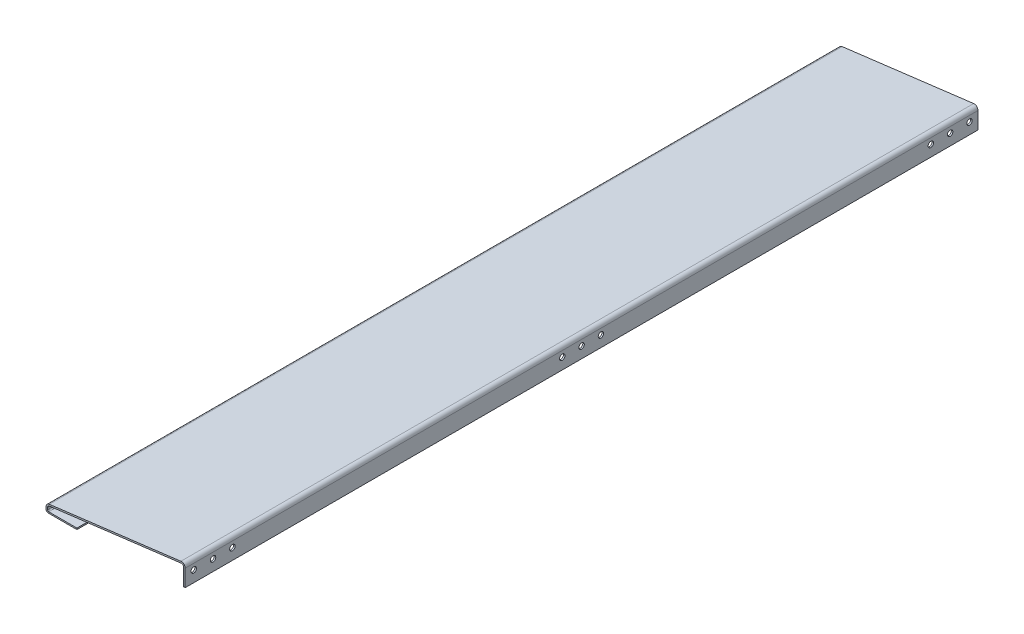
ISO-10303-21;
HEADER;
FILE_DESCRIPTION(('STEP AP214'),'2;1');
FILE_NAME('part.step','',(''),(''),'','','');
FILE_SCHEMA(('AUTOMOTIVE_DESIGN { 1 0 10303 214 1 1 1 1 }'));
ENDSEC;
DATA;
#1=APPLICATION_CONTEXT('core data for automotive mechanical design processes');
#2=APPLICATION_PROTOCOL_DEFINITION('international standard','automotive_design',2000,#1);
#3=PRODUCT_CONTEXT('',#1,'mechanical');
#4=PRODUCT('Part','Part','',(#3));
#5=PRODUCT_RELATED_PRODUCT_CATEGORY('part','',(#4));
#6=PRODUCT_DEFINITION_FORMATION('','',#4);
#7=PRODUCT_DEFINITION_CONTEXT('part definition',#1,'design');
#8=PRODUCT_DEFINITION('design','',#6,#7);
#9=PRODUCT_DEFINITION_SHAPE('','',#8);
#10=(LENGTH_UNIT() NAMED_UNIT(*) SI_UNIT(.MILLI.,.METRE.));
#11=(NAMED_UNIT(*) PLANE_ANGLE_UNIT() SI_UNIT($,.RADIAN.));
#12=(NAMED_UNIT(*) SI_UNIT($,.STERADIAN.) SOLID_ANGLE_UNIT());
#13=UNCERTAINTY_MEASURE_WITH_UNIT(LENGTH_MEASURE(1.E-05),#10,'distance_accuracy_value','');
#14=(GEOMETRIC_REPRESENTATION_CONTEXT(3) GLOBAL_UNCERTAINTY_ASSIGNED_CONTEXT((#13)) GLOBAL_UNIT_ASSIGNED_CONTEXT((#10,
#11,#12)) REPRESENTATION_CONTEXT('',''));
#15=CARTESIAN_POINT('',(0.,0.,0.));
#16=DIRECTION('',(0.,0.,1.));
#17=DIRECTION('',(1.,0.,0.));
#18=AXIS2_PLACEMENT_3D('',#15,#16,#17);
#19=CARTESIAN_POINT('',(-360.,-10.,2050.));
#20=DIRECTION('',(0.,1.,0.));
#21=DIRECTION('',(0.,0.,1.));
#22=AXIS2_PLACEMENT_3D('',#19,#20,#21);
#23=PLANE('',#22);
#24=DIRECTION('',(1.,0.,0.));
#25=VECTOR('',#24,1.);
#26=CARTESIAN_POINT('',(-360.,-10.,2050.));
#27=LINE('',#26,#25);
#28=CARTESIAN_POINT('',(-353.5,-10.,2050.));
#29=VERTEX_POINT('',#28);
#30=CARTESIAN_POINT('',(-280.,-10.,2050.));
#31=VERTEX_POINT('',#30);
#32=EDGE_CURVE('E282',#29,#31,#27,.T.);
#33=ORIENTED_EDGE('',*,*,#32,.F.);
#34=DIRECTION('',(0.,0.,-1.));
#35=VECTOR('',#34,1.);
#36=CARTESIAN_POINT('',(-353.5,-10.,2050.));
#37=LINE('',#36,#35);
#38=CARTESIAN_POINT('',(-353.5,-10.,0.));
#39=VERTEX_POINT('',#38);
#40=EDGE_CURVE('E153',#29,#39,#37,.T.);
#41=ORIENTED_EDGE('',*,*,#40,.T.);
#42=DIRECTION('',(1.,0.,0.));
#43=VECTOR('',#42,1.);
#44=CARTESIAN_POINT('',(-360.,-10.,0.));
#45=LINE('',#44,#43);
#46=CARTESIAN_POINT('',(-280.,-10.,0.));
#47=VERTEX_POINT('',#46);
#48=EDGE_CURVE('E147',#39,#47,#45,.T.);
#49=ORIENTED_EDGE('',*,*,#48,.T.);
#50=DIRECTION('',(0.,0.,1.));
#51=VECTOR('',#50,1.);
#52=CARTESIAN_POINT('',(-280.,-10.,0.));
#53=LINE('',#52,#51);
#54=EDGE_CURVE('E150',#47,#31,#53,.T.);
#55=ORIENTED_EDGE('',*,*,#54,.T.);
#56=EDGE_LOOP('',(#33,#41,#49,#55));
#57=FACE_BOUND('',#56,.T.);
#58=ADVANCED_FACE('F34',(#57),#23,.F.);
#59=CARTESIAN_POINT('',(-300.,-10.,2050.));
#60=DIRECTION('',(-0.0333148302326385,0.999444906979154,0.));
#61=DIRECTION('',(-0.999444906979154,-0.0333148302326385,0.));
#62=AXIS2_PLACEMENT_3D('',#59,#60,#61);
#63=PLANE('',#62);
#64=DIRECTION('',(0.999444906979154,0.0333148302326385,0.));
#65=VECTOR('',#64,1.);
#66=CARTESIAN_POINT('',(-300.,-10.,2050.));
#67=LINE('',#66,#65);
#68=CARTESIAN_POINT('',(-4.,-0.133333333333334,2050.));
#69=VERTEX_POINT('',#68);
#70=CARTESIAN_POINT('',(0.,0.,2050.));
#71=VERTEX_POINT('',#70);
#72=EDGE_CURVE('E155',#69,#71,#67,.T.);
#73=ORIENTED_EDGE('',*,*,#72,.F.);
#74=DIRECTION('',(0.,0.,-1.));
#75=VECTOR('',#74,1.);
#76=CARTESIAN_POINT('',(-4.,-0.133333333333334,2050.));
#77=LINE('',#76,#75);
#78=CARTESIAN_POINT('',(-4.,-0.133333333333334,0.));
#79=VERTEX_POINT('',#78);
#80=EDGE_CURVE('E236',#69,#79,#77,.T.);
#81=ORIENTED_EDGE('',*,*,#80,.T.);
#82=DIRECTION('',(0.999444906979154,0.0333148302326385,0.));
#83=VECTOR('',#82,1.);
#84=CARTESIAN_POINT('',(-300.,-10.,0.));
#85=LINE('',#84,#83);
#86=CARTESIAN_POINT('',(0.,0.,0.));
#87=VERTEX_POINT('',#86);
#88=EDGE_CURVE('E249',#79,#87,#85,.T.);
#89=ORIENTED_EDGE('',*,*,#88,.T.);
#90=DIRECTION('',(0.,0.,-1.));
#91=VECTOR('',#90,1.);
#92=CARTESIAN_POINT('',(0.,0.,2050.));
#93=LINE('',#92,#91);
#94=EDGE_CURVE('E306',#71,#87,#93,.T.);
#95=ORIENTED_EDGE('',*,*,#94,.F.);
#96=EDGE_LOOP('',(#73,#81,#89,#95));
#97=FACE_BOUND('',#96,.T.);
#98=ADVANCED_FACE('F357',(#97),#63,.F.);
#99=CARTESIAN_POINT('',(0.,0.,2050.));
#100=DIRECTION('',(-1.,0.,0.));
#101=DIRECTION('',(0.,0.,1.));
#102=AXIS2_PLACEMENT_3D('',#99,#100,#101);
#103=PLANE('',#102);
#104=CARTESIAN_POINT('',(0.,28.6721778146268,2028.));
#105=DIRECTION('',(1.,0.,0.));
#106=DIRECTION('',(0.,0.,-1.));
#107=AXIS2_PLACEMENT_3D('',#104,#105,#106);
#108=CIRCLE('',#107,6.99999999999994);
#109=CARTESIAN_POINT('',(0.,28.6721778146268,2021.));
#110=VERTEX_POINT('',#109);
#111=EDGE_CURVE('E182',#110,#110,#108,.T.);
#112=ORIENTED_EDGE('',*,*,#111,.F.);
#113=EDGE_LOOP('',(#112));
#114=FACE_BOUND('',#113,.T.);
#115=CARTESIAN_POINT('',(0.,28.6721778146271,21.9999999999998));
#116=DIRECTION('',(1.,0.,0.));
#117=DIRECTION('',(0.,0.,1.));
#118=AXIS2_PLACEMENT_3D('',#115,#116,#117);
#119=CIRCLE('',#118,6.99999999999994);
#120=CARTESIAN_POINT('',(0.,28.6721778146271,28.9999999999997));
#121=VERTEX_POINT('',#120);
#122=EDGE_CURVE('E202',#121,#121,#119,.T.);
#123=ORIENTED_EDGE('',*,*,#122,.F.);
#124=EDGE_LOOP('',(#123));
#125=FACE_BOUND('',#124,.T.);
#126=CARTESIAN_POINT('',(0.,28.6721778146268,1025.));
#127=DIRECTION('',(1.,0.,0.));
#128=DIRECTION('',(0.,0.,-1.));
#129=AXIS2_PLACEMENT_3D('',#126,#127,#128);
#130=CIRCLE('',#129,6.99999999999993);
#131=CARTESIAN_POINT('',(0.,28.6721778146268,1018.));
#132=VERTEX_POINT('',#131);
#133=EDGE_CURVE('E203',#132,#132,#130,.T.);
#134=ORIENTED_EDGE('',*,*,#133,.F.);
#135=EDGE_LOOP('',(#134));
#136=FACE_BOUND('',#135,.T.);
#137=CARTESIAN_POINT('',(0.,28.6721778146268,1075.));
#138=DIRECTION('',(1.,0.,0.));
#139=DIRECTION('',(0.,0.,-1.));
#140=AXIS2_PLACEMENT_3D('',#137,#138,#139);
#141=CIRCLE('',#140,6.99999999999993);
#142=CARTESIAN_POINT('',(0.,28.6721778146268,1068.));
#143=VERTEX_POINT('',#142);
#144=EDGE_CURVE('E190',#143,#143,#141,.T.);
#145=ORIENTED_EDGE('',*,*,#144,.F.);
#146=EDGE_LOOP('',(#145));
#147=FACE_BOUND('',#146,.T.);
#148=CARTESIAN_POINT('',(0.,28.6721778146268,975.));
#149=DIRECTION('',(1.,0.,0.));
#150=DIRECTION('',(0.,0.,-1.));
#151=AXIS2_PLACEMENT_3D('',#148,#149,#150);
#152=CIRCLE('',#151,7.00000000000004);
#153=CARTESIAN_POINT('',(0.,28.6721778146268,968.));
#154=VERTEX_POINT('',#153);
#155=EDGE_CURVE('E191',#154,#154,#152,.T.);
#156=ORIENTED_EDGE('',*,*,#155,.F.);
#157=EDGE_LOOP('',(#156));
#158=FACE_BOUND('',#157,.T.);
#159=CARTESIAN_POINT('',(0.,28.672177814627,71.9999999999998));
#160=DIRECTION('',(1.,0.,0.));
#161=DIRECTION('',(0.,0.,1.));
#162=AXIS2_PLACEMENT_3D('',#159,#160,#161);
#163=CIRCLE('',#162,6.99999999999993);
#164=CARTESIAN_POINT('',(0.,28.672177814627,78.9999999999998));
#165=VERTEX_POINT('',#164);
#166=EDGE_CURVE('E226',#165,#165,#163,.T.);
#167=ORIENTED_EDGE('',*,*,#166,.F.);
#168=EDGE_LOOP('',(#167));
#169=FACE_BOUND('',#168,.T.);
#170=CARTESIAN_POINT('',(0.,28.672177814627,122.));
#171=DIRECTION('',(1.,0.,0.));
#172=DIRECTION('',(0.,0.,1.));
#173=AXIS2_PLACEMENT_3D('',#170,#171,#172);
#174=CIRCLE('',#173,6.99999999999993);
#175=CARTESIAN_POINT('',(0.,28.672177814627,129.));
#176=VERTEX_POINT('',#175);
#177=EDGE_CURVE('E220',#176,#176,#174,.T.);
#178=ORIENTED_EDGE('',*,*,#177,.F.);
#179=EDGE_LOOP('',(#178));
#180=FACE_BOUND('',#179,.T.);
#181=CARTESIAN_POINT('',(0.,28.6721778146268,1928.));
#182=DIRECTION('',(1.,0.,0.));
#183=DIRECTION('',(0.,0.,-1.));
#184=AXIS2_PLACEMENT_3D('',#181,#182,#183);
#185=CIRCLE('',#184,6.99999999999993);
#186=CARTESIAN_POINT('',(0.,28.6721778146268,1921.));
#187=VERTEX_POINT('',#186);
#188=EDGE_CURVE('E214',#187,#187,#185,.T.);
#189=ORIENTED_EDGE('',*,*,#188,.F.);
#190=EDGE_LOOP('',(#189));
#191=FACE_BOUND('',#190,.T.);
#192=CARTESIAN_POINT('',(0.,28.6721778146268,1978.));
#193=DIRECTION('',(1.,0.,0.));
#194=DIRECTION('',(0.,0.,-1.));
#195=AXIS2_PLACEMENT_3D('',#192,#193,#194);
#196=CIRCLE('',#195,6.99999999999993);
#197=CARTESIAN_POINT('',(0.,28.6721778146268,1971.));
#198=VERTEX_POINT('',#197);
#199=EDGE_CURVE('E183',#198,#198,#196,.T.);
#200=ORIENTED_EDGE('',*,*,#199,.F.);
#201=EDGE_LOOP('',(#200));
#202=FACE_BOUND('',#201,.T.);
#203=DIRECTION('',(0.,1.,0.));
#204=VECTOR('',#203,1.);
#205=CARTESIAN_POINT('',(0.,0.,0.));
#206=LINE('',#205,#204);
#207=CARTESIAN_POINT('',(0.,43.6721778146268,0.));
#208=VERTEX_POINT('',#207);
#209=EDGE_CURVE('E286',#87,#208,#206,.T.);
#210=ORIENTED_EDGE('',*,*,#209,.T.);
#211=DIRECTION('',(0.,0.,-1.));
#212=VECTOR('',#211,1.);
#213=CARTESIAN_POINT('',(0.,43.6721778146268,2050.));
#214=LINE('',#213,#212);
#215=CARTESIAN_POINT('',(0.,43.6721778146268,2050.));
#216=VERTEX_POINT('',#215);
#217=EDGE_CURVE('E303',#216,#208,#214,.T.);
#218=ORIENTED_EDGE('',*,*,#217,.F.);
#219=DIRECTION('',(0.,1.,0.));
#220=VECTOR('',#219,1.);
#221=CARTESIAN_POINT('',(0.,0.,2050.));
#222=LINE('',#221,#220);
#223=EDGE_CURVE('E272',#71,#216,#222,.T.);
#224=ORIENTED_EDGE('',*,*,#223,.F.);
#225=ORIENTED_EDGE('',*,*,#94,.T.);
#226=EDGE_LOOP('',(#210,#218,#224,#225));
#227=FACE_BOUND('',#226,.T.);
#228=ADVANCED_FACE('F361',(#114,#125,#136,#147,#158,#169,#180,#191,#202,#227),#103,.F.);
#229=CARTESIAN_POINT('',(-10.,43.6721778146268,2050.));
#230=DIRECTION('',(0.,0.,-1.));
#231=DIRECTION('',(-1.,0.,0.));
#232=AXIS2_PLACEMENT_3D('',#229,#230,#231);
#233=CYLINDRICAL_SURFACE('',#232,10.);
#234=CARTESIAN_POINT('',(-10.,43.6721778146268,0.));
#235=DIRECTION('',(0.,0.,1.));
#236=DIRECTION('',(1.,0.,0.));
#237=AXIS2_PLACEMENT_3D('',#234,#235,#236);
#238=CIRCLE('',#237,10.);
#239=CARTESIAN_POINT('',(-11.2403473458921,53.5949565817635,0.));
#240=VERTEX_POINT('',#239);
#241=EDGE_CURVE('E288',#208,#240,#238,.T.);
#242=ORIENTED_EDGE('',*,*,#241,.T.);
#243=DIRECTION('',(0.,0.,-1.));
#244=VECTOR('',#243,1.);
#245=CARTESIAN_POINT('',(-11.2403473458921,53.5949565817635,2050.));
#246=LINE('',#245,#244);
#247=CARTESIAN_POINT('',(-11.2403473458921,53.5949565817635,2050.));
#248=VERTEX_POINT('',#247);
#249=EDGE_CURVE('E300',#248,#240,#246,.T.);
#250=ORIENTED_EDGE('',*,*,#249,.F.);
#251=CARTESIAN_POINT('',(-10.,43.6721778146268,2050.));
#252=DIRECTION('',(0.,0.,1.));
#253=DIRECTION('',(1.,0.,0.));
#254=AXIS2_PLACEMENT_3D('',#251,#252,#253);
#255=CIRCLE('',#254,10.);
#256=EDGE_CURVE('E274',#216,#248,#255,.T.);
#257=ORIENTED_EDGE('',*,*,#256,.F.);
#258=ORIENTED_EDGE('',*,*,#217,.T.);
#259=EDGE_LOOP('',(#242,#250,#257,#258));
#260=FACE_BOUND('',#259,.T.);
#261=ADVANCED_FACE('F365',(#260),#233,.T.);
#262=CARTESIAN_POINT('',(-11.2403473458921,53.5949565817635,2050.));
#263=DIRECTION('',(0.124034734589208,-0.992277876713668,0.));
#264=DIRECTION('',(0.992277876713668,0.124034734589208,0.));
#265=AXIS2_PLACEMENT_3D('',#262,#263,#264);
#266=PLANE('',#265);
#267=DIRECTION('',(-0.992277876713668,-0.124034734589208,0.));
#268=VECTOR('',#267,1.);
#269=CARTESIAN_POINT('',(-11.2403473458921,53.5949565817635,0.));
#270=LINE('',#269,#268);
#271=CARTESIAN_POINT('',(-351.240347345892,11.0949565817635,0.));
#272=VERTEX_POINT('',#271);
#273=EDGE_CURVE('E290',#240,#272,#270,.T.);
#274=ORIENTED_EDGE('',*,*,#273,.T.);
#275=DIRECTION('',(0.,0.,-1.));
#276=VECTOR('',#275,1.);
#277=CARTESIAN_POINT('',(-351.240347345892,11.0949565817635,2050.));
#278=LINE('',#277,#276);
#279=CARTESIAN_POINT('',(-351.240347345892,11.0949565817635,2050.));
#280=VERTEX_POINT('',#279);
#281=EDGE_CURVE('E297',#280,#272,#278,.T.);
#282=ORIENTED_EDGE('',*,*,#281,.F.);
#283=DIRECTION('',(-0.992277876713668,-0.124034734589208,0.));
#284=VECTOR('',#283,1.);
#285=CARTESIAN_POINT('',(-11.2403473458921,53.5949565817635,2050.));
#286=LINE('',#285,#284);
#287=EDGE_CURVE('E276',#248,#280,#286,.T.);
#288=ORIENTED_EDGE('',*,*,#287,.F.);
#289=ORIENTED_EDGE('',*,*,#249,.T.);
#290=EDGE_LOOP('',(#274,#282,#288,#289));
#291=FACE_BOUND('',#290,.T.);
#292=ADVANCED_FACE('F371',(#291),#266,.F.);
#293=CARTESIAN_POINT('',(-350.,1.17217781462682,2050.));
#294=DIRECTION('',(0.,0.,-1.));
#295=DIRECTION('',(-1.,0.,0.));
#296=AXIS2_PLACEMENT_3D('',#293,#294,#295);
#297=CYLINDRICAL_SURFACE('',#296,10.);
#298=CARTESIAN_POINT('',(-350.,1.17217781462682,0.));
#299=DIRECTION('',(0.,0.,1.));
#300=DIRECTION('',(-1.,0.,0.));
#301=AXIS2_PLACEMENT_3D('',#298,#299,#300);
#302=CIRCLE('',#301,10.);
#303=CARTESIAN_POINT('',(-360.,1.17217781462682,0.));
#304=VERTEX_POINT('',#303);
#305=EDGE_CURVE('E292',#272,#304,#302,.T.);
#306=ORIENTED_EDGE('',*,*,#305,.T.);
#307=DIRECTION('',(0.,0.,-1.));
#308=VECTOR('',#307,1.);
#309=CARTESIAN_POINT('',(-360.,1.17217781462682,2050.));
#310=LINE('',#309,#308);
#311=CARTESIAN_POINT('',(-360.,1.17217781462682,2050.));
#312=VERTEX_POINT('',#311);
#313=EDGE_CURVE('E284',#312,#304,#310,.T.);
#314=ORIENTED_EDGE('',*,*,#313,.F.);
#315=CARTESIAN_POINT('',(-350.,1.17217781462682,2050.));
#316=DIRECTION('',(0.,0.,1.));
#317=DIRECTION('',(-1.,0.,0.));
#318=AXIS2_PLACEMENT_3D('',#315,#316,#317);
#319=CIRCLE('',#318,10.);
#320=EDGE_CURVE('E278',#280,#312,#319,.T.);
#321=ORIENTED_EDGE('',*,*,#320,.F.);
#322=ORIENTED_EDGE('',*,*,#281,.T.);
#323=EDGE_LOOP('',(#306,#314,#321,#322));
#324=FACE_BOUND('',#323,.T.);
#325=ADVANCED_FACE('F375',(#324),#297,.T.);
#326=CARTESIAN_POINT('',(-360.,1.17217781462682,2050.));
#327=DIRECTION('',(1.,0.,0.));
#328=DIRECTION('',(0.,1.,0.));
#329=AXIS2_PLACEMENT_3D('',#326,#327,#328);
#330=PLANE('',#329);
#331=DIRECTION('',(0.,-1.,0.));
#332=VECTOR('',#331,1.);
#333=CARTESIAN_POINT('',(-360.,1.17217781462682,0.));
#334=LINE('',#333,#332);
#335=CARTESIAN_POINT('',(-360.,-3.50000000000003,0.));
#336=VERTEX_POINT('',#335);
#337=EDGE_CURVE('E156',#304,#336,#334,.T.);
#338=ORIENTED_EDGE('',*,*,#337,.T.);
#339=DIRECTION('',(0.,0.,-1.));
#340=VECTOR('',#339,1.);
#341=CARTESIAN_POINT('',(-360.,-3.50000000000003,2050.));
#342=LINE('',#341,#340);
#343=CARTESIAN_POINT('',(-360.,-3.50000000000003,2050.));
#344=VERTEX_POINT('',#343);
#345=EDGE_CURVE('E42',#336,#344,#342,.F.);
#346=ORIENTED_EDGE('',*,*,#345,.T.);
#347=DIRECTION('',(0.,-1.,0.));
#348=VECTOR('',#347,1.);
#349=CARTESIAN_POINT('',(-360.,1.17217781462682,2050.));
#350=LINE('',#349,#348);
#351=EDGE_CURVE('E280',#312,#344,#350,.T.);
#352=ORIENTED_EDGE('',*,*,#351,.F.);
#353=ORIENTED_EDGE('',*,*,#313,.T.);
#354=EDGE_LOOP('',(#338,#346,#352,#353));
#355=FACE_BOUND('',#354,.T.);
#356=ADVANCED_FACE('F376',(#355),#330,.F.);
#357=CARTESIAN_POINT('',(-10.,43.6721778146268,2050.));
#358=DIRECTION('',(0.,0.,1.));
#359=DIRECTION('',(1.,0.,0.));
#360=AXIS2_PLACEMENT_3D('',#357,#358,#359);
#361=PLANE('',#360);
#362=ORIENTED_EDGE('',*,*,#351,.T.);
#363=CARTESIAN_POINT('',(-353.5,-3.5,2050.));
#364=DIRECTION('',(0.,0.,1.));
#365=DIRECTION('',(1.,0.,0.));
#366=AXIS2_PLACEMENT_3D('',#363,#364,#365);
#367=CIRCLE('',#366,6.5);
#368=EDGE_CURVE('E11',#344,#29,#367,.T.);
#369=ORIENTED_EDGE('',*,*,#368,.T.);
#370=ORIENTED_EDGE('',*,*,#32,.T.);
#371=DIRECTION('',(0.,1.,0.));
#372=VECTOR('',#371,1.);
#373=CARTESIAN_POINT('',(-280.,-10.,2050.));
#374=LINE('',#373,#372);
#375=CARTESIAN_POINT('',(-280.,-6.5,2050.));
#376=VERTEX_POINT('',#375);
#377=EDGE_CURVE('E164',#31,#376,#374,.T.);
#378=ORIENTED_EDGE('',*,*,#377,.T.);
#379=DIRECTION('',(-1.,0.,0.));
#380=VECTOR('',#379,1.);
#381=CARTESIAN_POINT('',(-360.,-6.5,2050.));
#382=LINE('',#381,#380);
#383=CARTESIAN_POINT('',(-353.,-6.5,2050.));
#384=VERTEX_POINT('',#383);
#385=EDGE_CURVE('E170',#376,#384,#382,.T.);
#386=ORIENTED_EDGE('',*,*,#385,.T.);
#387=CARTESIAN_POINT('',(-353.,-3.5,2050.));
#388=DIRECTION('',(0.,0.,1.));
#389=DIRECTION('',(1.,0.,0.));
#390=AXIS2_PLACEMENT_3D('',#387,#388,#389);
#391=CIRCLE('',#390,3.);
#392=CARTESIAN_POINT('',(-356.,-3.50000000000002,2050.));
#393=VERTEX_POINT('',#392);
#394=EDGE_CURVE('E314',#384,#393,#391,.F.);
#395=ORIENTED_EDGE('',*,*,#394,.T.);
#396=DIRECTION('',(0.,-1.,0.));
#397=VECTOR('',#396,1.);
#398=CARTESIAN_POINT('',(-356.,1.17217781462684,2050.));
#399=LINE('',#398,#397);
#400=CARTESIAN_POINT('',(-356.,1.17217781462682,2050.));
#401=VERTEX_POINT('',#400);
#402=EDGE_CURVE('E243',#401,#393,#399,.T.);
#403=ORIENTED_EDGE('',*,*,#402,.F.);
#404=CARTESIAN_POINT('',(-350.,1.17217781462682,2050.));
#405=DIRECTION('',(0.,0.,1.));
#406=DIRECTION('',(1.,0.,0.));
#407=AXIS2_PLACEMENT_3D('',#404,#405,#406);
#408=CIRCLE('',#407,6.00000000000004);
#409=CARTESIAN_POINT('',(-350.744208407535,7.12584507490883,2050.));
#410=VERTEX_POINT('',#409);
#411=EDGE_CURVE('E257',#410,#401,#408,.T.);
#412=ORIENTED_EDGE('',*,*,#411,.F.);
#413=DIRECTION('',(-0.992277876713668,-0.124034734589208,0.));
#414=VECTOR('',#413,1.);
#415=CARTESIAN_POINT('',(-10.7442084075353,49.6258450749088,2050.));
#416=LINE('',#415,#414);
#417=CARTESIAN_POINT('',(-10.7442084075353,49.6258450749088,2050.));
#418=VERTEX_POINT('',#417);
#419=EDGE_CURVE('E255',#418,#410,#416,.T.);
#420=ORIENTED_EDGE('',*,*,#419,.F.);
#421=CARTESIAN_POINT('',(-10.,43.6721778146268,2050.));
#422=DIRECTION('',(0.,0.,1.));
#423=DIRECTION('',(1.,0.,0.));
#424=AXIS2_PLACEMENT_3D('',#421,#422,#423);
#425=CIRCLE('',#424,6.);
#426=CARTESIAN_POINT('',(-4.,43.6721778146268,2050.));
#427=VERTEX_POINT('',#426);
#428=EDGE_CURVE('E252',#427,#418,#425,.T.);
#429=ORIENTED_EDGE('',*,*,#428,.F.);
#430=DIRECTION('',(0.,1.,0.));
#431=VECTOR('',#430,1.);
#432=CARTESIAN_POINT('',(-4.,0.,2050.));
#433=LINE('',#432,#431);
#434=EDGE_CURVE('E250',#69,#427,#433,.T.);
#435=ORIENTED_EDGE('',*,*,#434,.F.);
#436=ORIENTED_EDGE('',*,*,#72,.T.);
#437=ORIENTED_EDGE('',*,*,#223,.T.);
#438=ORIENTED_EDGE('',*,*,#256,.T.);
#439=ORIENTED_EDGE('',*,*,#287,.T.);
#440=ORIENTED_EDGE('',*,*,#320,.T.);
#441=EDGE_LOOP('',(#362,#369,#370,#378,#386,#395,#403,#412,#420,#429,#435,#436,#437,#438,#439,#440));
#442=FACE_BOUND('',#441,.T.);
#443=ADVANCED_FACE('F330',(#442),#361,.T.);
#444=CARTESIAN_POINT('',(-10.,43.6721778146268,0.));
#445=DIRECTION('',(0.,0.,1.));
#446=DIRECTION('',(1.,0.,0.));
#447=AXIS2_PLACEMENT_3D('',#444,#445,#446);
#448=PLANE('',#447);
#449=ORIENTED_EDGE('',*,*,#48,.F.);
#450=CARTESIAN_POINT('',(-353.5,-3.5,0.));
#451=DIRECTION('',(0.,0.,1.));
#452=DIRECTION('',(1.,0.,0.));
#453=AXIS2_PLACEMENT_3D('',#450,#451,#452);
#454=CIRCLE('',#453,6.5);
#455=EDGE_CURVE('E56',#39,#336,#454,.F.);
#456=ORIENTED_EDGE('',*,*,#455,.T.);
#457=ORIENTED_EDGE('',*,*,#337,.F.);
#458=ORIENTED_EDGE('',*,*,#305,.F.);
#459=ORIENTED_EDGE('',*,*,#273,.F.);
#460=ORIENTED_EDGE('',*,*,#241,.F.);
#461=ORIENTED_EDGE('',*,*,#209,.F.);
#462=ORIENTED_EDGE('',*,*,#88,.F.);
#463=DIRECTION('',(0.,1.,0.));
#464=VECTOR('',#463,1.);
#465=CARTESIAN_POINT('',(-4.,0.,0.));
#466=LINE('',#465,#464);
#467=CARTESIAN_POINT('',(-4.,43.6721778146268,0.));
#468=VERTEX_POINT('',#467);
#469=EDGE_CURVE('E186',#79,#468,#466,.T.);
#470=ORIENTED_EDGE('',*,*,#469,.T.);
#471=CARTESIAN_POINT('',(-10.,43.6721778146268,0.));
#472=DIRECTION('',(0.,0.,1.));
#473=DIRECTION('',(1.,0.,0.));
#474=AXIS2_PLACEMENT_3D('',#471,#472,#473);
#475=CIRCLE('',#474,6.);
#476=CARTESIAN_POINT('',(-10.7442084075353,49.6258450749088,0.));
#477=VERTEX_POINT('',#476);
#478=EDGE_CURVE('E246',#468,#477,#475,.T.);
#479=ORIENTED_EDGE('',*,*,#478,.T.);
#480=DIRECTION('',(-0.992277876713668,-0.124034734589208,0.));
#481=VECTOR('',#480,1.);
#482=CARTESIAN_POINT('',(-10.7442084075353,49.6258450749088,0.));
#483=LINE('',#482,#481);
#484=CARTESIAN_POINT('',(-350.744208407535,7.12584507490883,-8.88178419700125E-13));
#485=VERTEX_POINT('',#484);
#486=EDGE_CURVE('E266',#477,#485,#483,.T.);
#487=ORIENTED_EDGE('',*,*,#486,.T.);
#488=CARTESIAN_POINT('',(-350.,1.17217781462682,0.));
#489=DIRECTION('',(0.,0.,1.));
#490=DIRECTION('',(1.,0.,0.));
#491=AXIS2_PLACEMENT_3D('',#488,#489,#490);
#492=CIRCLE('',#491,6.00000000000004);
#493=CARTESIAN_POINT('',(-356.,1.17217781462682,0.));
#494=VERTEX_POINT('',#493);
#495=EDGE_CURVE('E263',#485,#494,#492,.T.);
#496=ORIENTED_EDGE('',*,*,#495,.T.);
#497=DIRECTION('',(0.,-1.,0.));
#498=VECTOR('',#497,1.);
#499=CARTESIAN_POINT('',(-356.,1.17217781462684,0.));
#500=LINE('',#499,#498);
#501=CARTESIAN_POINT('',(-356.,-3.50000000000002,0.));
#502=VERTEX_POINT('',#501);
#503=EDGE_CURVE('E253',#494,#502,#500,.T.);
#504=ORIENTED_EDGE('',*,*,#503,.T.);
#505=CARTESIAN_POINT('',(-353.,-3.5,0.));
#506=DIRECTION('',(0.,0.,1.));
#507=DIRECTION('',(1.,0.,0.));
#508=AXIS2_PLACEMENT_3D('',#505,#506,#507);
#509=CIRCLE('',#508,3.);
#510=CARTESIAN_POINT('',(-353.,-6.5,0.));
#511=VERTEX_POINT('',#510);
#512=EDGE_CURVE('E316',#502,#511,#509,.T.);
#513=ORIENTED_EDGE('',*,*,#512,.T.);
#514=DIRECTION('',(-1.,0.,0.));
#515=VECTOR('',#514,1.);
#516=CARTESIAN_POINT('',(-360.,-6.5,0.));
#517=LINE('',#516,#515);
#518=CARTESIAN_POINT('',(-280.,-6.5,0.));
#519=VERTEX_POINT('',#518);
#520=EDGE_CURVE('E166',#519,#511,#517,.T.);
#521=ORIENTED_EDGE('',*,*,#520,.F.);
#522=DIRECTION('',(0.,1.,0.));
#523=VECTOR('',#522,1.);
#524=CARTESIAN_POINT('',(-280.,-10.,0.));
#525=LINE('',#524,#523);
#526=EDGE_CURVE('E161',#47,#519,#525,.T.);
#527=ORIENTED_EDGE('',*,*,#526,.F.);
#528=EDGE_LOOP('',(#449,#456,#457,#458,#459,#460,#461,#462,#470,#479,#487,#496,#504,#513,#521,#527));
#529=FACE_BOUND('',#528,.T.);
#530=ADVANCED_FACE('F168',(#529),#448,.F.);
#531=CARTESIAN_POINT('',(-4.,0.,2050.));
#532=DIRECTION('',(-1.,0.,0.));
#533=DIRECTION('',(0.,0.,1.));
#534=AXIS2_PLACEMENT_3D('',#531,#532,#533);
#535=PLANE('',#534);
#536=CARTESIAN_POINT('',(-4.,28.6721778146268,2028.));
#537=DIRECTION('',(-1.,0.,0.));
#538=DIRECTION('',(0.,0.,1.));
#539=AXIS2_PLACEMENT_3D('',#536,#537,#538);
#540=CIRCLE('',#539,6.99999999999994);
#541=CARTESIAN_POINT('',(-4.,28.6721778146268,2035.));
#542=VERTEX_POINT('',#541);
#543=EDGE_CURVE('E179',#542,#542,#540,.F.);
#544=ORIENTED_EDGE('',*,*,#543,.T.);
#545=EDGE_LOOP('',(#544));
#546=FACE_BOUND('',#545,.T.);
#547=CARTESIAN_POINT('',(-4.,28.6721778146271,21.9999999999998));
#548=DIRECTION('',(-1.,0.,0.));
#549=DIRECTION('',(0.,0.,1.));
#550=AXIS2_PLACEMENT_3D('',#547,#548,#549);
#551=CIRCLE('',#550,6.99999999999994);
#552=CARTESIAN_POINT('',(-4.,28.6721778146271,28.9999999999997));
#553=VERTEX_POINT('',#552);
#554=EDGE_CURVE('E199',#553,#553,#551,.F.);
#555=ORIENTED_EDGE('',*,*,#554,.T.);
#556=EDGE_LOOP('',(#555));
#557=FACE_BOUND('',#556,.T.);
#558=CARTESIAN_POINT('',(-4.,28.6721778146268,1025.));
#559=DIRECTION('',(-1.,0.,0.));
#560=DIRECTION('',(0.,0.,1.));
#561=AXIS2_PLACEMENT_3D('',#558,#559,#560);
#562=CIRCLE('',#561,6.99999999999993);
#563=CARTESIAN_POINT('',(-4.,28.6721778146268,1032.));
#564=VERTEX_POINT('',#563);
#565=EDGE_CURVE('E194',#564,#564,#562,.F.);
#566=ORIENTED_EDGE('',*,*,#565,.T.);
#567=EDGE_LOOP('',(#566));
#568=FACE_BOUND('',#567,.T.);
#569=CARTESIAN_POINT('',(-4.,28.6721778146268,1075.));
#570=DIRECTION('',(-1.,0.,0.));
#571=DIRECTION('',(0.,0.,1.));
#572=AXIS2_PLACEMENT_3D('',#569,#570,#571);
#573=CIRCLE('',#572,6.99999999999993);
#574=CARTESIAN_POINT('',(-4.,28.6721778146268,1082.));
#575=VERTEX_POINT('',#574);
#576=EDGE_CURVE('E187',#575,#575,#573,.F.);
#577=ORIENTED_EDGE('',*,*,#576,.T.);
#578=EDGE_LOOP('',(#577));
#579=FACE_BOUND('',#578,.T.);
#580=CARTESIAN_POINT('',(-4.,28.6721778146268,975.));
#581=DIRECTION('',(-1.,0.,0.));
#582=DIRECTION('',(0.,0.,1.));
#583=AXIS2_PLACEMENT_3D('',#580,#581,#582);
#584=CIRCLE('',#583,7.00000000000004);
#585=CARTESIAN_POINT('',(-4.,28.6721778146268,982.));
#586=VERTEX_POINT('',#585);
#587=EDGE_CURVE('E177',#586,#586,#584,.F.);
#588=ORIENTED_EDGE('',*,*,#587,.T.);
#589=EDGE_LOOP('',(#588));
#590=FACE_BOUND('',#589,.T.);
#591=CARTESIAN_POINT('',(-4.,28.672177814627,71.9999999999998));
#592=DIRECTION('',(-1.,0.,0.));
#593=DIRECTION('',(0.,0.,1.));
#594=AXIS2_PLACEMENT_3D('',#591,#592,#593);
#595=CIRCLE('',#594,6.99999999999993);
#596=CARTESIAN_POINT('',(-4.,28.672177814627,78.9999999999998));
#597=VERTEX_POINT('',#596);
#598=EDGE_CURVE('E206',#597,#597,#595,.F.);
#599=ORIENTED_EDGE('',*,*,#598,.T.);
#600=EDGE_LOOP('',(#599));
#601=FACE_BOUND('',#600,.T.);
#602=CARTESIAN_POINT('',(-4.,28.672177814627,122.));
#603=DIRECTION('',(-1.,0.,0.));
#604=DIRECTION('',(0.,0.,1.));
#605=AXIS2_PLACEMENT_3D('',#602,#603,#604);
#606=CIRCLE('',#605,6.99999999999993);
#607=CARTESIAN_POINT('',(-4.,28.672177814627,129.));
#608=VERTEX_POINT('',#607);
#609=EDGE_CURVE('E223',#608,#608,#606,.F.);
#610=ORIENTED_EDGE('',*,*,#609,.T.);
#611=EDGE_LOOP('',(#610));
#612=FACE_BOUND('',#611,.T.);
#613=CARTESIAN_POINT('',(-4.,28.6721778146268,1928.));
#614=DIRECTION('',(-1.,0.,0.));
#615=DIRECTION('',(0.,0.,1.));
#616=AXIS2_PLACEMENT_3D('',#613,#614,#615);
#617=CIRCLE('',#616,6.99999999999993);
#618=CARTESIAN_POINT('',(-4.,28.6721778146268,1935.));
#619=VERTEX_POINT('',#618);
#620=EDGE_CURVE('E217',#619,#619,#617,.F.);
#621=ORIENTED_EDGE('',*,*,#620,.T.);
#622=EDGE_LOOP('',(#621));
#623=FACE_BOUND('',#622,.T.);
#624=CARTESIAN_POINT('',(-4.,28.6721778146268,1978.));
#625=DIRECTION('',(-1.,0.,0.));
#626=DIRECTION('',(0.,0.,1.));
#627=AXIS2_PLACEMENT_3D('',#624,#625,#626);
#628=CIRCLE('',#627,6.99999999999993);
#629=CARTESIAN_POINT('',(-4.,28.6721778146268,1985.));
#630=VERTEX_POINT('',#629);
#631=EDGE_CURVE('E211',#630,#630,#628,.F.);
#632=ORIENTED_EDGE('',*,*,#631,.T.);
#633=EDGE_LOOP('',(#632));
#634=FACE_BOUND('',#633,.T.);
#635=ORIENTED_EDGE('',*,*,#469,.F.);
#636=ORIENTED_EDGE('',*,*,#80,.F.);
#637=ORIENTED_EDGE('',*,*,#434,.T.);
#638=DIRECTION('',(0.,0.,-1.));
#639=VECTOR('',#638,1.);
#640=CARTESIAN_POINT('',(-4.,43.6721778146268,2050.));
#641=LINE('',#640,#639);
#642=EDGE_CURVE('E233',#427,#468,#641,.T.);
#643=ORIENTED_EDGE('',*,*,#642,.T.);
#644=EDGE_LOOP('',(#635,#636,#637,#643));
#645=FACE_BOUND('',#644,.T.);
#646=ADVANCED_FACE('F350',(#546,#557,#568,#579,#590,#601,#612,#623,#634,#645),#535,.T.);
#647=CARTESIAN_POINT('',(-10.,43.6721778146268,2050.));
#648=DIRECTION('',(0.,0.,-1.));
#649=DIRECTION('',(-1.,0.,0.));
#650=AXIS2_PLACEMENT_3D('',#647,#648,#649);
#651=CYLINDRICAL_SURFACE('',#650,6.);
#652=ORIENTED_EDGE('',*,*,#478,.F.);
#653=ORIENTED_EDGE('',*,*,#642,.F.);
#654=ORIENTED_EDGE('',*,*,#428,.T.);
#655=DIRECTION('',(0.,0.,1.));
#656=VECTOR('',#655,1.);
#657=CARTESIAN_POINT('',(-10.7442084075353,49.6258450749088,2050.));
#658=LINE('',#657,#656);
#659=EDGE_CURVE('E237',#418,#477,#658,.F.);
#660=ORIENTED_EDGE('',*,*,#659,.T.);
#661=EDGE_LOOP('',(#652,#653,#654,#660));
#662=FACE_BOUND('',#661,.T.);
#663=ADVANCED_FACE('F347',(#662),#651,.F.);
#664=CARTESIAN_POINT('',(-10.7442084075353,49.6258450749088,2050.));
#665=DIRECTION('',(0.124034734589208,-0.992277876713668,0.));
#666=DIRECTION('',(0.992277876713668,0.124034734589208,0.));
#667=AXIS2_PLACEMENT_3D('',#664,#665,#666);
#668=PLANE('',#667);
#669=ORIENTED_EDGE('',*,*,#486,.F.);
#670=ORIENTED_EDGE('',*,*,#659,.F.);
#671=ORIENTED_EDGE('',*,*,#419,.T.);
#672=DIRECTION('',(0.,0.,-1.));
#673=VECTOR('',#672,1.);
#674=CARTESIAN_POINT('',(-350.744208407535,7.12584507490887,2050.));
#675=LINE('',#674,#673);
#676=EDGE_CURVE('E239',#410,#485,#675,.T.);
#677=ORIENTED_EDGE('',*,*,#676,.T.);
#678=EDGE_LOOP('',(#669,#670,#671,#677));
#679=FACE_BOUND('',#678,.T.);
#680=ADVANCED_FACE('F345',(#679),#668,.T.);
#681=CARTESIAN_POINT('',(-350.,1.17217781462682,2050.));
#682=DIRECTION('',(0.,0.,-1.));
#683=DIRECTION('',(-1.,0.,0.));
#684=AXIS2_PLACEMENT_3D('',#681,#682,#683);
#685=CYLINDRICAL_SURFACE('',#684,6.00000000000004);
#686=ORIENTED_EDGE('',*,*,#495,.F.);
#687=ORIENTED_EDGE('',*,*,#676,.F.);
#688=ORIENTED_EDGE('',*,*,#411,.T.);
#689=DIRECTION('',(0.,0.,1.));
#690=VECTOR('',#689,1.);
#691=CARTESIAN_POINT('',(-356.,1.17217781462684,2050.));
#692=LINE('',#691,#690);
#693=EDGE_CURVE('E241',#401,#494,#692,.F.);
#694=ORIENTED_EDGE('',*,*,#693,.T.);
#695=EDGE_LOOP('',(#686,#687,#688,#694));
#696=FACE_BOUND('',#695,.T.);
#697=ADVANCED_FACE('F337',(#696),#685,.F.);
#698=CARTESIAN_POINT('',(-356.,1.17217781462684,2050.));
#699=DIRECTION('',(1.,0.,0.));
#700=DIRECTION('',(0.,1.,0.));
#701=AXIS2_PLACEMENT_3D('',#698,#699,#700);
#702=PLANE('',#701);
#703=ORIENTED_EDGE('',*,*,#402,.T.);
#704=DIRECTION('',(0.,0.,1.));
#705=VECTOR('',#704,1.);
#706=CARTESIAN_POINT('',(-356.,-3.50000000000002,0.));
#707=LINE('',#706,#705);
#708=EDGE_CURVE('E312',#393,#502,#707,.F.);
#709=ORIENTED_EDGE('',*,*,#708,.T.);
#710=ORIENTED_EDGE('',*,*,#503,.F.);
#711=ORIENTED_EDGE('',*,*,#693,.F.);
#712=EDGE_LOOP('',(#703,#709,#710,#711));
#713=FACE_BOUND('',#712,.T.);
#714=ADVANCED_FACE('F334',(#713),#702,.T.);
#715=CARTESIAN_POINT('',(-360.001,28.6721778146268,1978.));
#716=DIRECTION('',(1.,0.,0.));
#717=DIRECTION('',(0.,0.,-1.));
#718=AXIS2_PLACEMENT_3D('',#715,#716,#717);
#719=CYLINDRICAL_SURFACE('',#718,6.99999999999993);
#720=ORIENTED_EDGE('',*,*,#631,.F.);
#721=EDGE_LOOP('',(#720));
#722=FACE_BOUND('',#721,.T.);
#723=ORIENTED_EDGE('',*,*,#199,.T.);
#724=EDGE_LOOP('',(#723));
#725=FACE_BOUND('',#724,.T.);
#726=ADVANCED_FACE('F422',(#722,#725),#719,.F.);
#727=CARTESIAN_POINT('',(-360.001,28.6721778146268,1928.));
#728=DIRECTION('',(1.,0.,0.));
#729=DIRECTION('',(0.,0.,-1.));
#730=AXIS2_PLACEMENT_3D('',#727,#728,#729);
#731=CYLINDRICAL_SURFACE('',#730,6.99999999999993);
#732=ORIENTED_EDGE('',*,*,#620,.F.);
#733=EDGE_LOOP('',(#732));
#734=FACE_BOUND('',#733,.T.);
#735=ORIENTED_EDGE('',*,*,#188,.T.);
#736=EDGE_LOOP('',(#735));
#737=FACE_BOUND('',#736,.T.);
#738=ADVANCED_FACE('F424',(#734,#737),#731,.F.);
#739=CARTESIAN_POINT('',(-360.001,28.672177814627,122.));
#740=DIRECTION('',(1.,0.,0.));
#741=DIRECTION('',(0.,0.,-1.));
#742=AXIS2_PLACEMENT_3D('',#739,#740,#741);
#743=CYLINDRICAL_SURFACE('',#742,6.99999999999993);
#744=ORIENTED_EDGE('',*,*,#609,.F.);
#745=EDGE_LOOP('',(#744));
#746=FACE_BOUND('',#745,.T.);
#747=ORIENTED_EDGE('',*,*,#177,.T.);
#748=EDGE_LOOP('',(#747));
#749=FACE_BOUND('',#748,.T.);
#750=ADVANCED_FACE('F431',(#746,#749),#743,.F.);
#751=CARTESIAN_POINT('',(-360.001,28.672177814627,71.9999999999998));
#752=DIRECTION('',(1.,0.,0.));
#753=DIRECTION('',(0.,0.,-1.));
#754=AXIS2_PLACEMENT_3D('',#751,#752,#753);
#755=CYLINDRICAL_SURFACE('',#754,6.99999999999993);
#756=ORIENTED_EDGE('',*,*,#598,.F.);
#757=EDGE_LOOP('',(#756));
#758=FACE_BOUND('',#757,.T.);
#759=ORIENTED_EDGE('',*,*,#166,.T.);
#760=EDGE_LOOP('',(#759));
#761=FACE_BOUND('',#760,.T.);
#762=ADVANCED_FACE('F442',(#758,#761),#755,.F.);
#763=CARTESIAN_POINT('',(-360.001,28.6721778146268,975.));
#764=DIRECTION('',(1.,0.,0.));
#765=DIRECTION('',(0.,0.,-1.));
#766=AXIS2_PLACEMENT_3D('',#763,#764,#765);
#767=CYLINDRICAL_SURFACE('',#766,7.00000000000004);
#768=ORIENTED_EDGE('',*,*,#587,.F.);
#769=EDGE_LOOP('',(#768));
#770=FACE_BOUND('',#769,.T.);
#771=ORIENTED_EDGE('',*,*,#155,.T.);
#772=EDGE_LOOP('',(#771));
#773=FACE_BOUND('',#772,.T.);
#774=ADVANCED_FACE('F446',(#770,#773),#767,.F.);
#775=CARTESIAN_POINT('',(-360.001,28.6721778146268,1075.));
#776=DIRECTION('',(1.,0.,0.));
#777=DIRECTION('',(0.,0.,-1.));
#778=AXIS2_PLACEMENT_3D('',#775,#776,#777);
#779=CYLINDRICAL_SURFACE('',#778,6.99999999999993);
#780=ORIENTED_EDGE('',*,*,#576,.F.);
#781=EDGE_LOOP('',(#780));
#782=FACE_BOUND('',#781,.T.);
#783=ORIENTED_EDGE('',*,*,#144,.T.);
#784=EDGE_LOOP('',(#783));
#785=FACE_BOUND('',#784,.T.);
#786=ADVANCED_FACE('F590',(#782,#785),#779,.F.);
#787=CARTESIAN_POINT('',(-360.001,28.6721778146268,1025.));
#788=DIRECTION('',(1.,0.,0.));
#789=DIRECTION('',(0.,0.,-1.));
#790=AXIS2_PLACEMENT_3D('',#787,#788,#789);
#791=CYLINDRICAL_SURFACE('',#790,6.99999999999993);
#792=ORIENTED_EDGE('',*,*,#565,.F.);
#793=EDGE_LOOP('',(#792));
#794=FACE_BOUND('',#793,.T.);
#795=ORIENTED_EDGE('',*,*,#133,.T.);
#796=EDGE_LOOP('',(#795));
#797=FACE_BOUND('',#796,.T.);
#798=ADVANCED_FACE('F437',(#794,#797),#791,.F.);
#799=CARTESIAN_POINT('',(-360.001,28.6721778146271,21.9999999999998));
#800=DIRECTION('',(1.,0.,0.));
#801=DIRECTION('',(0.,0.,-1.));
#802=AXIS2_PLACEMENT_3D('',#799,#800,#801);
#803=CYLINDRICAL_SURFACE('',#802,6.99999999999994);
#804=ORIENTED_EDGE('',*,*,#554,.F.);
#805=EDGE_LOOP('',(#804));
#806=FACE_BOUND('',#805,.T.);
#807=ORIENTED_EDGE('',*,*,#122,.T.);
#808=EDGE_LOOP('',(#807));
#809=FACE_BOUND('',#808,.T.);
#810=ADVANCED_FACE('F574',(#806,#809),#803,.F.);
#811=CARTESIAN_POINT('',(-360.001,28.6721778146268,2028.));
#812=DIRECTION('',(1.,0.,0.));
#813=DIRECTION('',(0.,0.,-1.));
#814=AXIS2_PLACEMENT_3D('',#811,#812,#813);
#815=CYLINDRICAL_SURFACE('',#814,6.99999999999994);
#816=ORIENTED_EDGE('',*,*,#543,.F.);
#817=EDGE_LOOP('',(#816));
#818=FACE_BOUND('',#817,.T.);
#819=ORIENTED_EDGE('',*,*,#111,.T.);
#820=EDGE_LOOP('',(#819));
#821=FACE_BOUND('',#820,.T.);
#822=ADVANCED_FACE('F498',(#818,#821),#815,.F.);
#823=CARTESIAN_POINT('',(-360.,-6.5,0.));
#824=DIRECTION('',(0.,1.,0.));
#825=DIRECTION('',(0.,0.,1.));
#826=AXIS2_PLACEMENT_3D('',#823,#824,#825);
#827=PLANE('',#826);
#828=ORIENTED_EDGE('',*,*,#520,.T.);
#829=DIRECTION('',(0.,0.,1.));
#830=VECTOR('',#829,1.);
#831=CARTESIAN_POINT('',(-353.,-6.5,2050.));
#832=LINE('',#831,#830);
#833=EDGE_CURVE('E309',#511,#384,#832,.T.);
#834=ORIENTED_EDGE('',*,*,#833,.T.);
#835=ORIENTED_EDGE('',*,*,#385,.F.);
#836=DIRECTION('',(0.,0.,1.));
#837=VECTOR('',#836,1.);
#838=CARTESIAN_POINT('',(-280.,-6.5,0.));
#839=LINE('',#838,#837);
#840=EDGE_CURVE('E165',#519,#376,#839,.T.);
#841=ORIENTED_EDGE('',*,*,#840,.F.);
#842=EDGE_LOOP('',(#828,#834,#835,#841));
#843=FACE_BOUND('',#842,.T.);
#844=ADVANCED_FACE('F325',(#843),#827,.T.);
#845=CARTESIAN_POINT('',(-280.,-10.,0.));
#846=DIRECTION('',(1.,0.,0.));
#847=DIRECTION('',(0.,0.,-1.));
#848=AXIS2_PLACEMENT_3D('',#845,#846,#847);
#849=PLANE('',#848);
#850=ORIENTED_EDGE('',*,*,#377,.F.);
#851=ORIENTED_EDGE('',*,*,#54,.F.);
#852=ORIENTED_EDGE('',*,*,#526,.T.);
#853=ORIENTED_EDGE('',*,*,#840,.T.);
#854=EDGE_LOOP('',(#850,#851,#852,#853));
#855=FACE_BOUND('',#854,.T.);
#856=ADVANCED_FACE('F160',(#855),#849,.T.);
#857=CARTESIAN_POINT('',(-353.,-3.5,0.));
#858=DIRECTION('',(0.,0.,-1.));
#859=DIRECTION('',(-1.,0.,0.));
#860=AXIS2_PLACEMENT_3D('',#857,#858,#859);
#861=CYLINDRICAL_SURFACE('',#860,3.);
#862=ORIENTED_EDGE('',*,*,#512,.F.);
#863=ORIENTED_EDGE('',*,*,#708,.F.);
#864=ORIENTED_EDGE('',*,*,#394,.F.);
#865=ORIENTED_EDGE('',*,*,#833,.F.);
#866=EDGE_LOOP('',(#862,#863,#864,#865));
#867=FACE_BOUND('',#866,.T.);
#868=ADVANCED_FACE('F327',(#867),#861,.F.);
#869=CARTESIAN_POINT('',(-353.5,-3.5,2050.));
#870=DIRECTION('',(0.,0.,-1.));
#871=DIRECTION('',(-1.,0.,0.));
#872=AXIS2_PLACEMENT_3D('',#869,#870,#871);
#873=CYLINDRICAL_SURFACE('',#872,6.5);
#874=ORIENTED_EDGE('',*,*,#368,.F.);
#875=ORIENTED_EDGE('',*,*,#345,.F.);
#876=ORIENTED_EDGE('',*,*,#455,.F.);
#877=ORIENTED_EDGE('',*,*,#40,.F.);
#878=EDGE_LOOP('',(#874,#875,#876,#877));
#879=FACE_BOUND('',#878,.T.);
#880=ADVANCED_FACE('F36',(#879),#873,.T.);
#881=CLOSED_SHELL('',(#58,#98,#228,#261,#292,#325,#356,#443,#530,#646,#663,#680,#697,#714,#726,
#738,#750,#762,#774,#786,#798,#810,#822,#844,#856,#868,#880));
#882=MANIFOLD_SOLID_BREP('B2',#881);
#883=ADVANCED_BREP_SHAPE_REPRESENTATION('',(#18,#882),#14);
#884=SHAPE_DEFINITION_REPRESENTATION(#9,#883);
ENDSEC;
END-ISO-10303-21;
